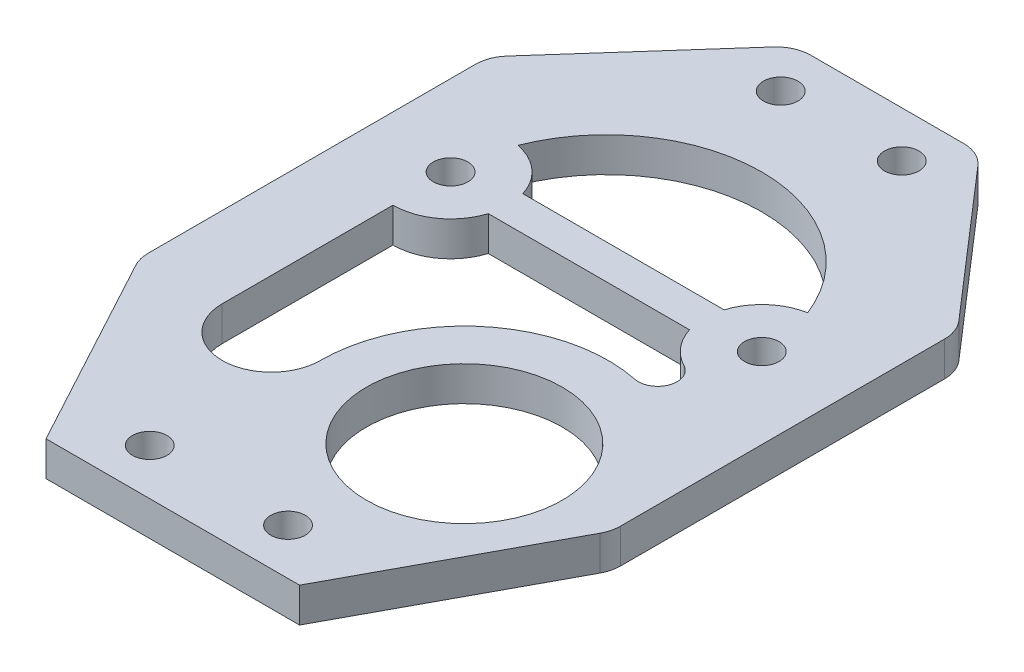
ISO-10303-21;
HEADER;
FILE_DESCRIPTION(('STEP AP214'),'2;1');
FILE_NAME('part.step','',(''),(''),'','','');
FILE_SCHEMA(('AUTOMOTIVE_DESIGN { 1 0 10303 214 1 1 1 1 }'));
ENDSEC;
DATA;
#1=APPLICATION_CONTEXT('core data for automotive mechanical design processes');
#2=APPLICATION_PROTOCOL_DEFINITION('international standard','automotive_design',2000,#1);
#3=PRODUCT_CONTEXT('',#1,'mechanical');
#4=PRODUCT('Part','Part','',(#3));
#5=PRODUCT_RELATED_PRODUCT_CATEGORY('part','',(#4));
#6=PRODUCT_DEFINITION_FORMATION('','',#4);
#7=PRODUCT_DEFINITION_CONTEXT('part definition',#1,'design');
#8=PRODUCT_DEFINITION('design','',#6,#7);
#9=PRODUCT_DEFINITION_SHAPE('','',#8);
#10=(LENGTH_UNIT() NAMED_UNIT(*) SI_UNIT(.MILLI.,.METRE.));
#11=(NAMED_UNIT(*) PLANE_ANGLE_UNIT() SI_UNIT($,.RADIAN.));
#12=(NAMED_UNIT(*) SI_UNIT($,.STERADIAN.) SOLID_ANGLE_UNIT());
#13=UNCERTAINTY_MEASURE_WITH_UNIT(LENGTH_MEASURE(1.E-05),#10,'distance_accuracy_value','');
#14=(GEOMETRIC_REPRESENTATION_CONTEXT(3) GLOBAL_UNCERTAINTY_ASSIGNED_CONTEXT((#13)) GLOBAL_UNIT_ASSIGNED_CONTEXT((#10,
#11,#12)) REPRESENTATION_CONTEXT('',''));
#15=CARTESIAN_POINT('',(0.,0.,0.));
#16=DIRECTION('',(0.,0.,1.));
#17=DIRECTION('',(1.,0.,0.));
#18=AXIS2_PLACEMENT_3D('',#15,#16,#17);
#19=CARTESIAN_POINT('',(0.,3.,0.));
#20=DIRECTION('',(0.,-1.,0.));
#21=DIRECTION('',(0.,0.,-1.));
#22=AXIS2_PLACEMENT_3D('',#19,#20,#21);
#23=PLANE('',#22);
#24=CARTESIAN_POINT('',(0.,3.,-37.6053139252812));
#25=DIRECTION('',(0.,1.,0.));
#26=DIRECTION('',(0.,0.,1.));
#27=AXIS2_PLACEMENT_3D('',#24,#25,#26);
#28=CIRCLE('',#27,13.5);
#29=CARTESIAN_POINT('',(12.5740740740741,3.,-42.5188321332151));
#30=VERTEX_POINT('',#29);
#31=CARTESIAN_POINT('',(-12.5740740740741,3.,-42.5188321332151));
#32=VERTEX_POINT('',#31);
#33=EDGE_CURVE('E265',#30,#32,#28,.T.);
#34=ORIENTED_EDGE('',*,*,#33,.F.);
#35=CARTESIAN_POINT('',(13.5,3.,-37.6053139252812));
#36=DIRECTION('',(0.,-1.,0.));
#37=DIRECTION('',(0.,0.,1.));
#38=AXIS2_PLACEMENT_3D('',#35,#36,#37);
#39=CIRCLE('',#38,5.);
#40=CARTESIAN_POINT('',(8.73030399291527,3.,-39.1053139252812));
#41=VERTEX_POINT('',#40);
#42=EDGE_CURVE('E273',#41,#30,#39,.T.);
#43=ORIENTED_EDGE('',*,*,#42,.F.);
#44=DIRECTION('',(1.,0.,0.));
#45=VECTOR('',#44,1.);
#46=CARTESIAN_POINT('',(-8.73030399291527,3.,-39.1053139252812));
#47=LINE('',#46,#45);
#48=CARTESIAN_POINT('',(-8.73030399291527,3.,-39.1053139252812));
#49=VERTEX_POINT('',#48);
#50=EDGE_CURVE('E270',#49,#41,#47,.T.);
#51=ORIENTED_EDGE('',*,*,#50,.F.);
#52=CARTESIAN_POINT('',(-13.5,3.,-37.6053139252812));
#53=DIRECTION('',(0.,-1.,0.));
#54=DIRECTION('',(0.,0.,1.));
#55=AXIS2_PLACEMENT_3D('',#52,#53,#54);
#56=CIRCLE('',#55,5.);
#57=EDGE_CURVE('E267',#32,#49,#56,.T.);
#58=ORIENTED_EDGE('',*,*,#57,.F.);
#59=EDGE_LOOP('',(#34,#43,#51,#58));
#60=FACE_BOUND('',#59,.T.);
#61=DIRECTION('',(-0.655356752303595,0.,-0.755319486846516));
#62=VECTOR('',#61,1.);
#63=CARTESIAN_POINT('',(20.4896217834169,3.,-47.6053139252812));
#64=LINE('',#63,#62);
#65=CARTESIAN_POINT('',(19.7555802439564,3.,-48.4513201302382));
#66=VERTEX_POINT('',#65);
#67=CARTESIAN_POINT('',(8.897094342647,3.,-60.9660702569108));
#68=VERTEX_POINT('',#67);
#69=EDGE_CURVE('E349',#66,#68,#64,.T.);
#70=ORIENTED_EDGE('',*,*,#69,.T.);
#71=CARTESIAN_POINT('',(6.63113588210745,3.,-59.));
#72=DIRECTION('',(0.,-1.,0.));
#73=DIRECTION('',(0.,0.,-1.));
#74=AXIS2_PLACEMENT_3D('',#71,#72,#73);
#75=CIRCLE('',#74,3.);
#76=CARTESIAN_POINT('',(6.63113588210745,3.,-62.));
#77=VERTEX_POINT('',#76);
#78=EDGE_CURVE('E415',#68,#77,#75,.F.);
#79=ORIENTED_EDGE('',*,*,#78,.T.);
#80=DIRECTION('',(-1.,0.,0.));
#81=VECTOR('',#80,1.);
#82=CARTESIAN_POINT('',(-8.,3.,-62.));
#83=LINE('',#82,#81);
#84=CARTESIAN_POINT('',(-6.65173417985051,3.,-62.));
#85=VERTEX_POINT('',#84);
#86=EDGE_CURVE('E352',#77,#85,#83,.T.);
#87=ORIENTED_EDGE('',*,*,#86,.T.);
#88=CARTESIAN_POINT('',(-6.65173417985051,3.,-59.));
#89=DIRECTION('',(0.,-1.,0.));
#90=DIRECTION('',(0.,0.,-1.));
#91=AXIS2_PLACEMENT_3D('',#88,#89,#90);
#92=CIRCLE('',#91,3.);
#93=CARTESIAN_POINT('',(-8.89514210708874,3.,-60.9917632570174));
#94=VERTEX_POINT('',#93);
#95=EDGE_CURVE('E407',#85,#94,#92,.F.);
#96=ORIENTED_EDGE('',*,*,#95,.T.);
#97=DIRECTION('',(-0.663921085672479,0.,0.747802642412741));
#98=VECTOR('',#97,1.);
#99=CARTESIAN_POINT('',(-20.5092438158278,3.,-47.9103050318304));
#100=LINE('',#99,#98);
#101=CARTESIAN_POINT('',(-19.752651743066,3.,-48.7624869604503));
#102=VERTEX_POINT('',#101);
#103=EDGE_CURVE('E355',#94,#102,#100,.T.);
#104=ORIENTED_EDGE('',*,*,#103,.T.);
#105=CARTESIAN_POINT('',(-17.5092438158278,3.,-46.7707237034328));
#106=DIRECTION('',(0.,-1.,0.));
#107=DIRECTION('',(0.,0.,-1.));
#108=AXIS2_PLACEMENT_3D('',#105,#106,#107);
#109=CIRCLE('',#108,3.);
#110=CARTESIAN_POINT('',(-20.5092438158278,3.,-46.7707237034328));
#111=VERTEX_POINT('',#110);
#112=EDGE_CURVE('E54',#102,#111,#109,.F.);
#113=ORIENTED_EDGE('',*,*,#112,.T.);
#114=DIRECTION('',(0.,0.,1.));
#115=VECTOR('',#114,1.);
#116=CARTESIAN_POINT('',(-20.5092438158278,3.,-17.6107061318947));
#117=LINE('',#116,#115);
#118=CARTESIAN_POINT('',(-20.5092438158278,3.,-18.3689229306085));
#119=VERTEX_POINT('',#118);
#120=EDGE_CURVE('E357',#111,#119,#117,.T.);
#121=ORIENTED_EDGE('',*,*,#120,.T.);
#122=CARTESIAN_POINT('',(-17.5092438158278,3.,-18.3689229306085));
#123=DIRECTION('',(0.,-1.,0.));
#124=DIRECTION('',(0.,0.,-1.));
#125=AXIS2_PLACEMENT_3D('',#122,#123,#124);
#126=CIRCLE('',#125,3.);
#127=CARTESIAN_POINT('',(-20.1489936922811,3.,-16.9435385649848));
#128=VERTEX_POINT('',#127);
#129=EDGE_CURVE('E409',#119,#128,#126,.F.);
#130=ORIENTED_EDGE('',*,*,#129,.T.);
#131=DIRECTION('',(0.475128121874568,0.,0.879916625484452));
#132=VECTOR('',#131,1.);
#133=CARTESIAN_POINT('',(-11.,3.,0.));
#134=LINE('',#133,#132);
#135=CARTESIAN_POINT('',(-11.,3.,0.));
#136=VERTEX_POINT('',#135);
#137=EDGE_CURVE('E338',#128,#136,#134,.T.);
#138=ORIENTED_EDGE('',*,*,#137,.T.);
#139=DIRECTION('',(1.,0.,0.));
#140=VECTOR('',#139,1.);
#141=CARTESIAN_POINT('',(-11.,3.,0.));
#142=LINE('',#141,#140);
#143=CARTESIAN_POINT('',(11.,3.,0.));
#144=VERTEX_POINT('',#143);
#145=EDGE_CURVE('E340',#136,#144,#142,.T.);
#146=ORIENTED_EDGE('',*,*,#145,.T.);
#147=DIRECTION('',(0.474481089170844,0.,-0.88026569626406));
#148=VECTOR('',#147,1.);
#149=CARTESIAN_POINT('',(11.,3.,0.));
#150=LINE('',#149,#148);
#151=CARTESIAN_POINT('',(20.1304188722091,3.,-16.9389143406592));
#152=VERTEX_POINT('',#151);
#153=EDGE_CURVE('E343',#144,#152,#150,.T.);
#154=ORIENTED_EDGE('',*,*,#153,.T.);
#155=CARTESIAN_POINT('',(17.4896217834169,3.,-18.3623576081718));
#156=DIRECTION('',(0.,-1.,0.));
#157=DIRECTION('',(0.,0.,-1.));
#158=AXIS2_PLACEMENT_3D('',#155,#156,#157);
#159=CIRCLE('',#158,3.);
#160=CARTESIAN_POINT('',(20.4896217834169,3.,-18.3623576081718));
#161=VERTEX_POINT('',#160);
#162=EDGE_CURVE('E411',#152,#161,#159,.F.);
#163=ORIENTED_EDGE('',*,*,#162,.T.);
#164=DIRECTION('',(0.,0.,-1.));
#165=VECTOR('',#164,1.);
#166=CARTESIAN_POINT('',(20.4896217834169,3.,-17.6053139252812));
#167=LINE('',#166,#165);
#168=CARTESIAN_POINT('',(20.4896217834169,3.,-46.4852498733274));
#169=VERTEX_POINT('',#168);
#170=EDGE_CURVE('E346',#161,#169,#167,.T.);
#171=ORIENTED_EDGE('',*,*,#170,.T.);
#172=CARTESIAN_POINT('',(17.4896217834169,3.,-46.4852498733274));
#173=DIRECTION('',(0.,-1.,0.));
#174=DIRECTION('',(0.,0.,-1.));
#175=AXIS2_PLACEMENT_3D('',#172,#173,#174);
#176=CIRCLE('',#175,3.);
#177=EDGE_CURVE('E413',#169,#66,#176,.F.);
#178=ORIENTED_EDGE('',*,*,#177,.T.);
#179=EDGE_LOOP('',(#70,#79,#87,#96,#104,#113,#121,#130,#138,#146,#154,#163,#171,#178));
#180=FACE_BOUND('',#179,.T.);
#181=CARTESIAN_POINT('',(7.51967974135512,3.,-17.7802522731615));
#182=DIRECTION('',(0.,1.,0.));
#183=DIRECTION('',(0.,0.,1.));
#184=AXIS2_PLACEMENT_3D('',#181,#182,#183);
#185=CIRCLE('',#184,8.5);
#186=CARTESIAN_POINT('',(7.51967974135512,3.,-9.28025227316154));
#187=VERTEX_POINT('',#186);
#188=EDGE_CURVE('E332',#187,#187,#185,.T.);
#189=ORIENTED_EDGE('',*,*,#188,.F.);
#190=EDGE_LOOP('',(#189));
#191=FACE_BOUND('',#190,.T.);
#192=CARTESIAN_POINT('',(6.,3.,-4.));
#193=DIRECTION('',(0.,1.,0.));
#194=DIRECTION('',(0.,0.,1.));
#195=AXIS2_PLACEMENT_3D('',#192,#193,#194);
#196=CIRCLE('',#195,1.5);
#197=CARTESIAN_POINT('',(6.,3.,-2.5));
#198=VERTEX_POINT('',#197);
#199=EDGE_CURVE('E326',#198,#198,#196,.T.);
#200=ORIENTED_EDGE('',*,*,#199,.F.);
#201=EDGE_LOOP('',(#200));
#202=FACE_BOUND('',#201,.T.);
#203=CARTESIAN_POINT('',(-6.,3.,-4.));
#204=DIRECTION('',(0.,1.,0.));
#205=DIRECTION('',(0.,0.,-1.));
#206=AXIS2_PLACEMENT_3D('',#203,#204,#205);
#207=CIRCLE('',#206,1.5);
#208=CARTESIAN_POINT('',(-6.,3.,-5.5));
#209=VERTEX_POINT('',#208);
#210=EDGE_CURVE('E320',#209,#209,#207,.T.);
#211=ORIENTED_EDGE('',*,*,#210,.F.);
#212=EDGE_LOOP('',(#211));
#213=FACE_BOUND('',#212,.T.);
#214=CARTESIAN_POINT('',(-5.25,3.,-57.9998597647943));
#215=DIRECTION('',(0.,1.,0.));
#216=DIRECTION('',(0.,0.,1.));
#217=AXIS2_PLACEMENT_3D('',#214,#215,#216);
#218=CIRCLE('',#217,1.5);
#219=CARTESIAN_POINT('',(-5.25,3.,-56.4998597647943));
#220=VERTEX_POINT('',#219);
#221=EDGE_CURVE('E314',#220,#220,#218,.T.);
#222=ORIENTED_EDGE('',*,*,#221,.F.);
#223=EDGE_LOOP('',(#222));
#224=FACE_BOUND('',#223,.T.);
#225=CARTESIAN_POINT('',(5.25,3.,-57.9998597647943));
#226=DIRECTION('',(0.,1.,0.));
#227=DIRECTION('',(0.,0.,1.));
#228=AXIS2_PLACEMENT_3D('',#225,#226,#227);
#229=CIRCLE('',#228,1.5);
#230=CARTESIAN_POINT('',(5.25,3.,-56.4998597647943));
#231=VERTEX_POINT('',#230);
#232=EDGE_CURVE('E308',#231,#231,#229,.T.);
#233=ORIENTED_EDGE('',*,*,#232,.F.);
#234=EDGE_LOOP('',(#233));
#235=FACE_BOUND('',#234,.T.);
#236=CARTESIAN_POINT('',(-13.5,3.,-37.6053139252812));
#237=DIRECTION('',(0.,1.,0.));
#238=DIRECTION('',(0.,0.,1.));
#239=AXIS2_PLACEMENT_3D('',#236,#237,#238);
#240=CIRCLE('',#239,1.5);
#241=CARTESIAN_POINT('',(-13.5,3.,-36.1053139252812));
#242=VERTEX_POINT('',#241);
#243=EDGE_CURVE('E302',#242,#242,#240,.T.);
#244=ORIENTED_EDGE('',*,*,#243,.F.);
#245=EDGE_LOOP('',(#244));
#246=FACE_BOUND('',#245,.T.);
#247=CARTESIAN_POINT('',(13.5,3.,-37.6053139252812));
#248=DIRECTION('',(0.,1.,0.));
#249=DIRECTION('',(0.,0.,1.));
#250=AXIS2_PLACEMENT_3D('',#247,#248,#249);
#251=CIRCLE('',#250,1.5);
#252=CARTESIAN_POINT('',(13.5,3.,-36.1053139252812));
#253=VERTEX_POINT('',#252);
#254=EDGE_CURVE('E296',#253,#253,#251,.T.);
#255=ORIENTED_EDGE('',*,*,#254,.F.);
#256=EDGE_LOOP('',(#255));
#257=FACE_BOUND('',#256,.T.);
#258=CARTESIAN_POINT('',(10.4065115949403,3.,-31.6734989005387));
#259=DIRECTION('',(0.,1.,0.));
#260=DIRECTION('',(0.,0.,1.));
#261=AXIS2_PLACEMENT_3D('',#258,#259,#260);
#262=CIRCLE('',#261,1.69);
#263=CARTESIAN_POINT('',(10.0626958209756,3.,-30.0188416207453));
#264=VERTEX_POINT('',#263);
#265=CARTESIAN_POINT('',(11.1879757809718,3.,-33.1719693626934));
#266=VERTEX_POINT('',#265);
#267=EDGE_CURVE('E202',#264,#266,#262,.T.);
#268=ORIENTED_EDGE('',*,*,#267,.F.);
#269=CARTESIAN_POINT('',(7.51967974135512,3.,-17.7802522731615));
#270=DIRECTION('',(0.,-1.,0.));
#271=DIRECTION('',(0.,0.,1.));
#272=AXIS2_PLACEMENT_3D('',#269,#270,#271);
#273=CIRCLE('',#272,12.5);
#274=CARTESIAN_POINT('',(-4.98031895754973,3.,-17.7859555508932));
#275=VERTEX_POINT('',#274);
#276=EDGE_CURVE('E236',#275,#264,#273,.T.);
#277=ORIENTED_EDGE('',*,*,#276,.F.);
#278=CARTESIAN_POINT('',(-9.24015925707654,3.,-17.7878991552812));
#279=DIRECTION('',(0.,1.,0.));
#280=DIRECTION('',(0.,0.,1.));
#281=AXIS2_PLACEMENT_3D('',#278,#279,#280);
#282=CIRCLE('',#281,4.25984074292346);
#283=CARTESIAN_POINT('',(-13.5,3.,-17.7878991552812));
#284=VERTEX_POINT('',#283);
#285=EDGE_CURVE('E233',#284,#275,#282,.T.);
#286=ORIENTED_EDGE('',*,*,#285,.F.);
#287=DIRECTION('',(0.,0.,1.));
#288=VECTOR('',#287,1.);
#289=CARTESIAN_POINT('',(-13.5,3.,-32.6053139252812));
#290=LINE('',#289,#288);
#291=CARTESIAN_POINT('',(-13.5,3.,-32.6053139252812));
#292=VERTEX_POINT('',#291);
#293=EDGE_CURVE('E231',#292,#284,#290,.T.);
#294=ORIENTED_EDGE('',*,*,#293,.F.);
#295=CARTESIAN_POINT('',(-13.5,3.,-37.6053139252812));
#296=DIRECTION('',(0.,-1.,0.));
#297=DIRECTION('',(0.,0.,1.));
#298=AXIS2_PLACEMENT_3D('',#295,#296,#297);
#299=CIRCLE('',#298,5.);
#300=CARTESIAN_POINT('',(-8.73030399291527,3.,-36.1053139252812));
#301=VERTEX_POINT('',#300);
#302=EDGE_CURVE('E227',#301,#292,#299,.T.);
#303=ORIENTED_EDGE('',*,*,#302,.F.);
#304=DIRECTION('',(-1.,0.,0.));
#305=VECTOR('',#304,1.);
#306=CARTESIAN_POINT('',(-8.73030399291527,3.,-36.1053139252812));
#307=LINE('',#306,#305);
#308=CARTESIAN_POINT('',(8.73030399291527,3.,-36.1053139252812));
#309=VERTEX_POINT('',#308);
#310=EDGE_CURVE('E225',#309,#301,#307,.T.);
#311=ORIENTED_EDGE('',*,*,#310,.F.);
#312=CARTESIAN_POINT('',(13.5,3.,-37.6053139252812));
#313=DIRECTION('',(0.,-1.,0.));
#314=DIRECTION('',(0.,0.,1.));
#315=AXIS2_PLACEMENT_3D('',#312,#313,#314);
#316=CIRCLE('',#315,5.);
#317=EDGE_CURVE('E212',#266,#309,#316,.T.);
#318=ORIENTED_EDGE('',*,*,#317,.F.);
#319=EDGE_LOOP('',(#268,#277,#286,#294,#303,#311,#318));
#320=FACE_BOUND('',#319,.T.);
#321=ADVANCED_FACE('F32',(#60,#180,#191,#202,#213,#224,#235,#246,#257,#320),#23,.F.);
#322=CARTESIAN_POINT('',(0.,0.,0.));
#323=DIRECTION('',(0.,-1.,0.));
#324=DIRECTION('',(0.,0.,-1.));
#325=AXIS2_PLACEMENT_3D('',#322,#323,#324);
#326=PLANE('',#325);
#327=CARTESIAN_POINT('',(-13.5,0.,-37.6053139252812));
#328=DIRECTION('',(0.,1.,0.));
#329=DIRECTION('',(0.,0.,1.));
#330=AXIS2_PLACEMENT_3D('',#327,#328,#329);
#331=CIRCLE('',#330,1.5);
#332=CARTESIAN_POINT('',(-13.5,0.,-36.1053139252812));
#333=VERTEX_POINT('',#332);
#334=EDGE_CURVE('E299',#333,#333,#331,.T.);
#335=ORIENTED_EDGE('',*,*,#334,.T.);
#336=EDGE_LOOP('',(#335));
#337=FACE_BOUND('',#336,.T.);
#338=CARTESIAN_POINT('',(-5.25,0.,-57.9998597647943));
#339=DIRECTION('',(0.,1.,0.));
#340=DIRECTION('',(0.,0.,1.));
#341=AXIS2_PLACEMENT_3D('',#338,#339,#340);
#342=CIRCLE('',#341,1.5);
#343=CARTESIAN_POINT('',(-5.25,0.,-56.4998597647943));
#344=VERTEX_POINT('',#343);
#345=EDGE_CURVE('E311',#344,#344,#342,.T.);
#346=ORIENTED_EDGE('',*,*,#345,.T.);
#347=EDGE_LOOP('',(#346));
#348=FACE_BOUND('',#347,.T.);
#349=CARTESIAN_POINT('',(6.,0.,-4.));
#350=DIRECTION('',(0.,1.,0.));
#351=DIRECTION('',(0.,0.,1.));
#352=AXIS2_PLACEMENT_3D('',#349,#350,#351);
#353=CIRCLE('',#352,1.5);
#354=CARTESIAN_POINT('',(6.,0.,-2.5));
#355=VERTEX_POINT('',#354);
#356=EDGE_CURVE('E323',#355,#355,#353,.T.);
#357=ORIENTED_EDGE('',*,*,#356,.T.);
#358=EDGE_LOOP('',(#357));
#359=FACE_BOUND('',#358,.T.);
#360=DIRECTION('',(-1.,0.,0.));
#361=VECTOR('',#360,1.);
#362=CARTESIAN_POINT('',(-8.,0.,-62.));
#363=LINE('',#362,#361);
#364=CARTESIAN_POINT('',(6.63113588210745,0.,-62.));
#365=VERTEX_POINT('',#364);
#366=CARTESIAN_POINT('',(-6.65173417985051,0.,-62.));
#367=VERTEX_POINT('',#366);
#368=EDGE_CURVE('E372',#365,#367,#363,.T.);
#369=ORIENTED_EDGE('',*,*,#368,.F.);
#370=CARTESIAN_POINT('',(6.63113588210745,0.,-59.));
#371=DIRECTION('',(0.,-1.,0.));
#372=DIRECTION('',(0.,0.,-1.));
#373=AXIS2_PLACEMENT_3D('',#370,#371,#372);
#374=CIRCLE('',#373,3.);
#375=CARTESIAN_POINT('',(8.897094342647,0.,-60.9660702569108));
#376=VERTEX_POINT('',#375);
#377=EDGE_CURVE('E399',#365,#376,#374,.T.);
#378=ORIENTED_EDGE('',*,*,#377,.T.);
#379=DIRECTION('',(-0.655356752303595,0.,-0.755319486846516));
#380=VECTOR('',#379,1.);
#381=CARTESIAN_POINT('',(20.4896217834169,0.,-47.6053139252812));
#382=LINE('',#381,#380);
#383=CARTESIAN_POINT('',(19.7555802439564,0.,-48.4513201302382));
#384=VERTEX_POINT('',#383);
#385=EDGE_CURVE('E369',#384,#376,#382,.T.);
#386=ORIENTED_EDGE('',*,*,#385,.F.);
#387=CARTESIAN_POINT('',(17.4896217834169,0.,-46.4852498733274));
#388=DIRECTION('',(0.,-1.,0.));
#389=DIRECTION('',(0.,0.,-1.));
#390=AXIS2_PLACEMENT_3D('',#387,#388,#389);
#391=CIRCLE('',#390,3.);
#392=CARTESIAN_POINT('',(20.4896217834169,0.,-46.4852498733274));
#393=VERTEX_POINT('',#392);
#394=EDGE_CURVE('E397',#384,#393,#391,.T.);
#395=ORIENTED_EDGE('',*,*,#394,.T.);
#396=DIRECTION('',(0.,0.,-1.));
#397=VECTOR('',#396,1.);
#398=CARTESIAN_POINT('',(20.4896217834169,0.,-17.6053139252812));
#399=LINE('',#398,#397);
#400=CARTESIAN_POINT('',(20.4896217834169,0.,-18.3623576081718));
#401=VERTEX_POINT('',#400);
#402=EDGE_CURVE('E366',#401,#393,#399,.T.);
#403=ORIENTED_EDGE('',*,*,#402,.F.);
#404=CARTESIAN_POINT('',(17.4896217834169,0.,-18.3623576081718));
#405=DIRECTION('',(0.,-1.,0.));
#406=DIRECTION('',(0.,0.,-1.));
#407=AXIS2_PLACEMENT_3D('',#404,#405,#406);
#408=CIRCLE('',#407,3.);
#409=CARTESIAN_POINT('',(20.1304188722091,0.,-16.9389143406592));
#410=VERTEX_POINT('',#409);
#411=EDGE_CURVE('E395',#401,#410,#408,.T.);
#412=ORIENTED_EDGE('',*,*,#411,.T.);
#413=DIRECTION('',(0.474481089170844,0.,-0.88026569626406));
#414=VECTOR('',#413,1.);
#415=CARTESIAN_POINT('',(11.,0.,0.));
#416=LINE('',#415,#414);
#417=CARTESIAN_POINT('',(11.,0.,0.));
#418=VERTEX_POINT('',#417);
#419=EDGE_CURVE('E363',#418,#410,#416,.T.);
#420=ORIENTED_EDGE('',*,*,#419,.F.);
#421=DIRECTION('',(1.,0.,0.));
#422=VECTOR('',#421,1.);
#423=CARTESIAN_POINT('',(-11.,0.,0.));
#424=LINE('',#423,#422);
#425=CARTESIAN_POINT('',(-11.,0.,0.));
#426=VERTEX_POINT('',#425);
#427=EDGE_CURVE('E361',#426,#418,#424,.T.);
#428=ORIENTED_EDGE('',*,*,#427,.F.);
#429=DIRECTION('',(0.475128121874568,0.,0.879916625484452));
#430=VECTOR('',#429,1.);
#431=CARTESIAN_POINT('',(-11.,0.,0.));
#432=LINE('',#431,#430);
#433=CARTESIAN_POINT('',(-20.1489936922811,0.,-16.9435385649848));
#434=VERTEX_POINT('',#433);
#435=EDGE_CURVE('E335',#434,#426,#432,.T.);
#436=ORIENTED_EDGE('',*,*,#435,.F.);
#437=CARTESIAN_POINT('',(-17.5092438158278,0.,-18.3689229306085));
#438=DIRECTION('',(0.,-1.,0.));
#439=DIRECTION('',(0.,0.,-1.));
#440=AXIS2_PLACEMENT_3D('',#437,#438,#439);
#441=CIRCLE('',#440,3.);
#442=CARTESIAN_POINT('',(-20.5092438158278,0.,-18.3689229306085));
#443=VERTEX_POINT('',#442);
#444=EDGE_CURVE('E393',#434,#443,#441,.T.);
#445=ORIENTED_EDGE('',*,*,#444,.T.);
#446=DIRECTION('',(0.,0.,1.));
#447=VECTOR('',#446,1.);
#448=CARTESIAN_POINT('',(-20.5092438158278,0.,-17.6107061318947));
#449=LINE('',#448,#447);
#450=CARTESIAN_POINT('',(-20.5092438158278,0.,-46.7707237034328));
#451=VERTEX_POINT('',#450);
#452=EDGE_CURVE('E341',#451,#443,#449,.T.);
#453=ORIENTED_EDGE('',*,*,#452,.F.);
#454=CARTESIAN_POINT('',(-17.5092438158278,0.,-46.7707237034328));
#455=DIRECTION('',(0.,-1.,0.));
#456=DIRECTION('',(0.,0.,-1.));
#457=AXIS2_PLACEMENT_3D('',#454,#455,#456);
#458=CIRCLE('',#457,3.);
#459=CARTESIAN_POINT('',(-19.752651743066,0.,-48.7624869604503));
#460=VERTEX_POINT('',#459);
#461=EDGE_CURVE('E389',#451,#460,#458,.T.);
#462=ORIENTED_EDGE('',*,*,#461,.T.);
#463=DIRECTION('',(-0.663921085672479,0.,0.747802642412741));
#464=VECTOR('',#463,1.);
#465=CARTESIAN_POINT('',(-20.5092438158278,0.,-47.9103050318304));
#466=LINE('',#465,#464);
#467=CARTESIAN_POINT('',(-8.89514210708874,0.,-60.9917632570174));
#468=VERTEX_POINT('',#467);
#469=EDGE_CURVE('E375',#468,#460,#466,.T.);
#470=ORIENTED_EDGE('',*,*,#469,.F.);
#471=CARTESIAN_POINT('',(-6.65173417985051,0.,-59.));
#472=DIRECTION('',(0.,-1.,0.));
#473=DIRECTION('',(0.,0.,-1.));
#474=AXIS2_PLACEMENT_3D('',#471,#472,#473);
#475=CIRCLE('',#474,3.);
#476=EDGE_CURVE('E391',#468,#367,#475,.T.);
#477=ORIENTED_EDGE('',*,*,#476,.T.);
#478=EDGE_LOOP('',(#369,#378,#386,#395,#403,#412,#420,#428,#436,#445,#453,#462,#470,#477));
#479=FACE_BOUND('',#478,.T.);
#480=CARTESIAN_POINT('',(7.51967974135512,0.,-17.7802522731615));
#481=DIRECTION('',(0.,1.,0.));
#482=DIRECTION('',(0.,0.,1.));
#483=AXIS2_PLACEMENT_3D('',#480,#481,#482);
#484=CIRCLE('',#483,8.5);
#485=CARTESIAN_POINT('',(7.51967974135512,0.,-9.28025227316154));
#486=VERTEX_POINT('',#485);
#487=EDGE_CURVE('E329',#486,#486,#484,.T.);
#488=ORIENTED_EDGE('',*,*,#487,.T.);
#489=EDGE_LOOP('',(#488));
#490=FACE_BOUND('',#489,.T.);
#491=CARTESIAN_POINT('',(-6.,0.,-4.));
#492=DIRECTION('',(0.,1.,0.));
#493=DIRECTION('',(0.,0.,-1.));
#494=AXIS2_PLACEMENT_3D('',#491,#492,#493);
#495=CIRCLE('',#494,1.5);
#496=CARTESIAN_POINT('',(-6.,0.,-5.5));
#497=VERTEX_POINT('',#496);
#498=EDGE_CURVE('E317',#497,#497,#495,.T.);
#499=ORIENTED_EDGE('',*,*,#498,.T.);
#500=EDGE_LOOP('',(#499));
#501=FACE_BOUND('',#500,.T.);
#502=CARTESIAN_POINT('',(5.25,0.,-57.9998597647943));
#503=DIRECTION('',(0.,1.,0.));
#504=DIRECTION('',(0.,0.,1.));
#505=AXIS2_PLACEMENT_3D('',#502,#503,#504);
#506=CIRCLE('',#505,1.5);
#507=CARTESIAN_POINT('',(5.25,0.,-56.4998597647943));
#508=VERTEX_POINT('',#507);
#509=EDGE_CURVE('E305',#508,#508,#506,.T.);
#510=ORIENTED_EDGE('',*,*,#509,.T.);
#511=EDGE_LOOP('',(#510));
#512=FACE_BOUND('',#511,.T.);
#513=CARTESIAN_POINT('',(13.5,0.,-37.6053139252812));
#514=DIRECTION('',(0.,1.,0.));
#515=DIRECTION('',(0.,0.,1.));
#516=AXIS2_PLACEMENT_3D('',#513,#514,#515);
#517=CIRCLE('',#516,1.5);
#518=CARTESIAN_POINT('',(13.5,0.,-36.1053139252812));
#519=VERTEX_POINT('',#518);
#520=EDGE_CURVE('E295',#519,#519,#517,.T.);
#521=ORIENTED_EDGE('',*,*,#520,.T.);
#522=EDGE_LOOP('',(#521));
#523=FACE_BOUND('',#522,.T.);
#524=CARTESIAN_POINT('',(13.5,0.,-37.6053139252812));
#525=DIRECTION('',(0.,-1.,0.));
#526=DIRECTION('',(0.,0.,1.));
#527=AXIS2_PLACEMENT_3D('',#524,#525,#526);
#528=CIRCLE('',#527,5.);
#529=CARTESIAN_POINT('',(8.73030399291527,0.,-39.1053139252812));
#530=VERTEX_POINT('',#529);
#531=CARTESIAN_POINT('',(12.5740740740741,0.,-42.5188321332151));
#532=VERTEX_POINT('',#531);
#533=EDGE_CURVE('E268',#530,#532,#528,.T.);
#534=ORIENTED_EDGE('',*,*,#533,.T.);
#535=CARTESIAN_POINT('',(0.,0.,-37.6053139252812));
#536=DIRECTION('',(0.,1.,0.));
#537=DIRECTION('',(0.,0.,1.));
#538=AXIS2_PLACEMENT_3D('',#535,#536,#537);
#539=CIRCLE('',#538,13.5);
#540=CARTESIAN_POINT('',(-12.5740740740741,0.,-42.5188321332151));
#541=VERTEX_POINT('',#540);
#542=EDGE_CURVE('E220',#532,#541,#539,.T.);
#543=ORIENTED_EDGE('',*,*,#542,.T.);
#544=CARTESIAN_POINT('',(-13.5,0.,-37.6053139252812));
#545=DIRECTION('',(0.,-1.,0.));
#546=DIRECTION('',(0.,0.,1.));
#547=AXIS2_PLACEMENT_3D('',#544,#545,#546);
#548=CIRCLE('',#547,5.);
#549=CARTESIAN_POINT('',(-8.73030399291527,0.,-39.1053139252812));
#550=VERTEX_POINT('',#549);
#551=EDGE_CURVE('E278',#541,#550,#548,.T.);
#552=ORIENTED_EDGE('',*,*,#551,.T.);
#553=DIRECTION('',(1.,0.,0.));
#554=VECTOR('',#553,1.);
#555=CARTESIAN_POINT('',(-8.73030399291527,0.,-39.1053139252812));
#556=LINE('',#555,#554);
#557=EDGE_CURVE('E281',#550,#530,#556,.T.);
#558=ORIENTED_EDGE('',*,*,#557,.T.);
#559=EDGE_LOOP('',(#534,#543,#552,#558));
#560=FACE_BOUND('',#559,.T.);
#561=CARTESIAN_POINT('',(7.51967974135512,0.,-17.7802522731615));
#562=DIRECTION('',(0.,-1.,0.));
#563=DIRECTION('',(0.,0.,1.));
#564=AXIS2_PLACEMENT_3D('',#561,#562,#563);
#565=CIRCLE('',#564,12.5);
#566=CARTESIAN_POINT('',(-4.98031895754973,0.,-17.7859555508932));
#567=VERTEX_POINT('',#566);
#568=CARTESIAN_POINT('',(10.0626958209756,0.,-30.0188416207453));
#569=VERTEX_POINT('',#568);
#570=EDGE_CURVE('E213',#567,#569,#565,.T.);
#571=ORIENTED_EDGE('',*,*,#570,.T.);
#572=CARTESIAN_POINT('',(10.4065115949403,0.,-31.6734989005387));
#573=DIRECTION('',(0.,1.,0.));
#574=DIRECTION('',(0.,0.,1.));
#575=AXIS2_PLACEMENT_3D('',#572,#573,#574);
#576=CIRCLE('',#575,1.69);
#577=CARTESIAN_POINT('',(11.1879757809718,0.,-33.1719693626934));
#578=VERTEX_POINT('',#577);
#579=EDGE_CURVE('E238',#569,#578,#576,.T.);
#580=ORIENTED_EDGE('',*,*,#579,.T.);
#581=CARTESIAN_POINT('',(13.5,0.,-37.6053139252812));
#582=DIRECTION('',(0.,-1.,0.));
#583=DIRECTION('',(0.,0.,1.));
#584=AXIS2_PLACEMENT_3D('',#581,#582,#583);
#585=CIRCLE('',#584,5.);
#586=CARTESIAN_POINT('',(8.73030399291527,0.,-36.1053139252812));
#587=VERTEX_POINT('',#586);
#588=EDGE_CURVE('E219',#578,#587,#585,.T.);
#589=ORIENTED_EDGE('',*,*,#588,.T.);
#590=DIRECTION('',(-1.,0.,0.));
#591=VECTOR('',#590,1.);
#592=CARTESIAN_POINT('',(-8.73030399291527,0.,-36.1053139252812));
#593=LINE('',#592,#591);
#594=CARTESIAN_POINT('',(-8.73030399291527,0.,-36.1053139252812));
#595=VERTEX_POINT('',#594);
#596=EDGE_CURVE('E241',#587,#595,#593,.T.);
#597=ORIENTED_EDGE('',*,*,#596,.T.);
#598=CARTESIAN_POINT('',(-13.5,0.,-37.6053139252812));
#599=DIRECTION('',(0.,-1.,0.));
#600=DIRECTION('',(0.,0.,1.));
#601=AXIS2_PLACEMENT_3D('',#598,#599,#600);
#602=CIRCLE('',#601,5.);
#603=CARTESIAN_POINT('',(-13.5,0.,-32.6053139252812));
#604=VERTEX_POINT('',#603);
#605=EDGE_CURVE('E244',#595,#604,#602,.T.);
#606=ORIENTED_EDGE('',*,*,#605,.T.);
#607=DIRECTION('',(0.,0.,1.));
#608=VECTOR('',#607,1.);
#609=CARTESIAN_POINT('',(-13.5,0.,-32.6053139252812));
#610=LINE('',#609,#608);
#611=CARTESIAN_POINT('',(-13.5,0.,-17.7878991552812));
#612=VERTEX_POINT('',#611);
#613=EDGE_CURVE('E247',#604,#612,#610,.T.);
#614=ORIENTED_EDGE('',*,*,#613,.T.);
#615=CARTESIAN_POINT('',(-9.24015925707654,0.,-17.7878991552812));
#616=DIRECTION('',(0.,1.,0.));
#617=DIRECTION('',(0.,0.,1.));
#618=AXIS2_PLACEMENT_3D('',#615,#616,#617);
#619=CIRCLE('',#618,4.25984074292346);
#620=EDGE_CURVE('E250',#612,#567,#619,.T.);
#621=ORIENTED_EDGE('',*,*,#620,.T.);
#622=EDGE_LOOP('',(#571,#580,#589,#597,#606,#614,#621));
#623=FACE_BOUND('',#622,.T.);
#624=ADVANCED_FACE('F444',(#337,#348,#359,#479,#490,#501,#512,#523,#560,#623),#326,.T.);
#625=CARTESIAN_POINT('',(-11.,3.,0.));
#626=DIRECTION('',(0.879916625484452,0.,-0.475128121874568));
#627=DIRECTION('',(-0.475128121874568,0.,-0.879916625484452));
#628=AXIS2_PLACEMENT_3D('',#625,#626,#627);
#629=PLANE('',#628);
#630=ORIENTED_EDGE('',*,*,#137,.F.);
#631=DIRECTION('',(0.,-1.,0.));
#632=VECTOR('',#631,1.);
#633=CARTESIAN_POINT('',(-20.1489936922811,3.,-16.9435385649848));
#634=LINE('',#633,#632);
#635=EDGE_CURVE('E424',#128,#434,#634,.T.);
#636=ORIENTED_EDGE('',*,*,#635,.T.);
#637=ORIENTED_EDGE('',*,*,#435,.T.);
#638=DIRECTION('',(0.,-1.,0.));
#639=VECTOR('',#638,1.);
#640=CARTESIAN_POINT('',(-11.,3.,0.));
#641=LINE('',#640,#639);
#642=EDGE_CURVE('E381',#136,#426,#641,.T.);
#643=ORIENTED_EDGE('',*,*,#642,.F.);
#644=EDGE_LOOP('',(#630,#636,#637,#643));
#645=FACE_BOUND('',#644,.T.);
#646=ADVANCED_FACE('F454',(#645),#629,.F.);
#647=CARTESIAN_POINT('',(-11.,3.,0.));
#648=DIRECTION('',(0.,0.,-1.));
#649=DIRECTION('',(-1.,0.,0.));
#650=AXIS2_PLACEMENT_3D('',#647,#648,#649);
#651=PLANE('',#650);
#652=ORIENTED_EDGE('',*,*,#427,.T.);
#653=DIRECTION('',(0.,-1.,0.));
#654=VECTOR('',#653,1.);
#655=CARTESIAN_POINT('',(11.,3.,0.));
#656=LINE('',#655,#654);
#657=EDGE_CURVE('E359',#144,#418,#656,.T.);
#658=ORIENTED_EDGE('',*,*,#657,.F.);
#659=ORIENTED_EDGE('',*,*,#145,.F.);
#660=ORIENTED_EDGE('',*,*,#642,.T.);
#661=EDGE_LOOP('',(#652,#658,#659,#660));
#662=FACE_BOUND('',#661,.T.);
#663=ADVANCED_FACE('F459',(#662),#651,.F.);
#664=CARTESIAN_POINT('',(11.,3.,0.));
#665=DIRECTION('',(-0.88026569626406,0.,-0.474481089170844));
#666=DIRECTION('',(-0.474481089170844,0.,0.88026569626406));
#667=AXIS2_PLACEMENT_3D('',#664,#665,#666);
#668=PLANE('',#667);
#669=ORIENTED_EDGE('',*,*,#419,.T.);
#670=DIRECTION('',(0.,-1.,0.));
#671=VECTOR('',#670,1.);
#672=CARTESIAN_POINT('',(20.1304188722091,3.,-16.9389143406592));
#673=LINE('',#672,#671);
#674=EDGE_CURVE('E422',#410,#152,#673,.F.);
#675=ORIENTED_EDGE('',*,*,#674,.T.);
#676=ORIENTED_EDGE('',*,*,#153,.F.);
#677=ORIENTED_EDGE('',*,*,#657,.T.);
#678=EDGE_LOOP('',(#669,#675,#676,#677));
#679=FACE_BOUND('',#678,.T.);
#680=ADVANCED_FACE('F463',(#679),#668,.F.);
#681=CARTESIAN_POINT('',(20.4896217834169,3.,-17.6053139252812));
#682=DIRECTION('',(-1.,0.,0.));
#683=DIRECTION('',(0.,0.,1.));
#684=AXIS2_PLACEMENT_3D('',#681,#682,#683);
#685=PLANE('',#684);
#686=ORIENTED_EDGE('',*,*,#402,.T.);
#687=DIRECTION('',(0.,-1.,0.));
#688=VECTOR('',#687,1.);
#689=CARTESIAN_POINT('',(20.4896217834169,3.,-46.4852498733274));
#690=LINE('',#689,#688);
#691=EDGE_CURVE('E420',#393,#169,#690,.F.);
#692=ORIENTED_EDGE('',*,*,#691,.T.);
#693=ORIENTED_EDGE('',*,*,#170,.F.);
#694=DIRECTION('',(0.,-1.,0.));
#695=VECTOR('',#694,1.);
#696=CARTESIAN_POINT('',(20.4896217834169,3.,-18.3623576081718));
#697=LINE('',#696,#695);
#698=EDGE_CURVE('E417',#161,#401,#697,.T.);
#699=ORIENTED_EDGE('',*,*,#698,.T.);
#700=EDGE_LOOP('',(#686,#692,#693,#699));
#701=FACE_BOUND('',#700,.T.);
#702=ADVANCED_FACE('F472',(#701),#685,.F.);
#703=CARTESIAN_POINT('',(20.4896217834169,3.,-47.6053139252812));
#704=DIRECTION('',(-0.755319486846516,0.,0.655356752303595));
#705=DIRECTION('',(0.655356752303595,0.,0.755319486846516));
#706=AXIS2_PLACEMENT_3D('',#703,#704,#705);
#707=PLANE('',#706);
#708=ORIENTED_EDGE('',*,*,#385,.T.);
#709=DIRECTION('',(0.,-1.,0.));
#710=VECTOR('',#709,1.);
#711=CARTESIAN_POINT('',(8.897094342647,3.,-60.9660702569108));
#712=LINE('',#711,#710);
#713=EDGE_CURVE('E404',#376,#68,#712,.F.);
#714=ORIENTED_EDGE('',*,*,#713,.T.);
#715=ORIENTED_EDGE('',*,*,#69,.F.);
#716=DIRECTION('',(0.,-1.,0.));
#717=VECTOR('',#716,1.);
#718=CARTESIAN_POINT('',(19.7555802439564,3.,-48.4513201302382));
#719=LINE('',#718,#717);
#720=EDGE_CURVE('E401',#66,#384,#719,.T.);
#721=ORIENTED_EDGE('',*,*,#720,.T.);
#722=EDGE_LOOP('',(#708,#714,#715,#721));
#723=FACE_BOUND('',#722,.T.);
#724=ADVANCED_FACE('F481',(#723),#707,.F.);
#725=CARTESIAN_POINT('',(-8.,3.,-62.));
#726=DIRECTION('',(0.,0.,1.));
#727=DIRECTION('',(1.,0.,0.));
#728=AXIS2_PLACEMENT_3D('',#725,#726,#727);
#729=PLANE('',#728);
#730=ORIENTED_EDGE('',*,*,#86,.F.);
#731=DIRECTION('',(0.,-1.,0.));
#732=VECTOR('',#731,1.);
#733=CARTESIAN_POINT('',(6.63113588210745,3.,-62.));
#734=LINE('',#733,#732);
#735=EDGE_CURVE('E386',#77,#365,#734,.T.);
#736=ORIENTED_EDGE('',*,*,#735,.T.);
#737=ORIENTED_EDGE('',*,*,#368,.T.);
#738=DIRECTION('',(0.,-1.,0.));
#739=VECTOR('',#738,1.);
#740=CARTESIAN_POINT('',(-6.65173417985051,3.,-62.));
#741=LINE('',#740,#739);
#742=EDGE_CURVE('E384',#367,#85,#741,.F.);
#743=ORIENTED_EDGE('',*,*,#742,.T.);
#744=EDGE_LOOP('',(#730,#736,#737,#743));
#745=FACE_BOUND('',#744,.T.);
#746=ADVANCED_FACE('F489',(#745),#729,.F.);
#747=CARTESIAN_POINT('',(-20.5092438158278,3.,-47.9103050318304));
#748=DIRECTION('',(0.747802642412741,0.,0.663921085672479));
#749=DIRECTION('',(0.663921085672479,0.,-0.747802642412741));
#750=AXIS2_PLACEMENT_3D('',#747,#748,#749);
#751=PLANE('',#750);
#752=ORIENTED_EDGE('',*,*,#103,.F.);
#753=DIRECTION('',(0.,-1.,0.));
#754=VECTOR('',#753,1.);
#755=CARTESIAN_POINT('',(-8.89514210708874,3.,-60.9917632570174));
#756=LINE('',#755,#754);
#757=EDGE_CURVE('E11',#94,#468,#756,.T.);
#758=ORIENTED_EDGE('',*,*,#757,.T.);
#759=ORIENTED_EDGE('',*,*,#469,.T.);
#760=DIRECTION('',(0.,-1.,0.));
#761=VECTOR('',#760,1.);
#762=CARTESIAN_POINT('',(-19.752651743066,3.,-48.7624869604503));
#763=LINE('',#762,#761);
#764=EDGE_CURVE('E40',#460,#102,#763,.F.);
#765=ORIENTED_EDGE('',*,*,#764,.T.);
#766=EDGE_LOOP('',(#752,#758,#759,#765));
#767=FACE_BOUND('',#766,.T.);
#768=ADVANCED_FACE('F433',(#767),#751,.F.);
#769=CARTESIAN_POINT('',(-20.5092438158278,3.,-17.6107061318947));
#770=DIRECTION('',(1.,0.,0.));
#771=DIRECTION('',(0.,0.,-1.));
#772=AXIS2_PLACEMENT_3D('',#769,#770,#771);
#773=PLANE('',#772);
#774=ORIENTED_EDGE('',*,*,#452,.T.);
#775=DIRECTION('',(0.,-1.,0.));
#776=VECTOR('',#775,1.);
#777=CARTESIAN_POINT('',(-20.5092438158278,3.,-18.3689229306085));
#778=LINE('',#777,#776);
#779=EDGE_CURVE('E47',#443,#119,#778,.F.);
#780=ORIENTED_EDGE('',*,*,#779,.T.);
#781=ORIENTED_EDGE('',*,*,#120,.F.);
#782=DIRECTION('',(0.,-1.,0.));
#783=VECTOR('',#782,1.);
#784=CARTESIAN_POINT('',(-20.5092438158278,3.,-46.7707237034328));
#785=LINE('',#784,#783);
#786=EDGE_CURVE('E427',#111,#451,#785,.T.);
#787=ORIENTED_EDGE('',*,*,#786,.T.);
#788=EDGE_LOOP('',(#774,#780,#781,#787));
#789=FACE_BOUND('',#788,.T.);
#790=ADVANCED_FACE('F441',(#789),#773,.F.);
#791=CARTESIAN_POINT('',(7.51967974135512,3.,-17.7802522731615));
#792=DIRECTION('',(0.,-1.,0.));
#793=DIRECTION('',(0.,0.,-1.));
#794=AXIS2_PLACEMENT_3D('',#791,#792,#793);
#795=CYLINDRICAL_SURFACE('',#794,8.5);
#796=ORIENTED_EDGE('',*,*,#188,.T.);
#797=EDGE_LOOP('',(#796));
#798=FACE_BOUND('',#797,.T.);
#799=ORIENTED_EDGE('',*,*,#487,.F.);
#800=EDGE_LOOP('',(#799));
#801=FACE_BOUND('',#800,.T.);
#802=ADVANCED_FACE('F509',(#798,#801),#795,.F.);
#803=CARTESIAN_POINT('',(6.,3.,-4.));
#804=DIRECTION('',(0.,-1.,0.));
#805=DIRECTION('',(0.,0.,-1.));
#806=AXIS2_PLACEMENT_3D('',#803,#804,#805);
#807=CYLINDRICAL_SURFACE('',#806,1.5);
#808=ORIENTED_EDGE('',*,*,#199,.T.);
#809=EDGE_LOOP('',(#808));
#810=FACE_BOUND('',#809,.T.);
#811=ORIENTED_EDGE('',*,*,#356,.F.);
#812=EDGE_LOOP('',(#811));
#813=FACE_BOUND('',#812,.T.);
#814=ADVANCED_FACE('F705',(#810,#813),#807,.F.);
#815=CARTESIAN_POINT('',(-6.,3.,-4.));
#816=DIRECTION('',(0.,-1.,0.));
#817=DIRECTION('',(0.,0.,-1.));
#818=AXIS2_PLACEMENT_3D('',#815,#816,#817);
#819=CYLINDRICAL_SURFACE('',#818,1.5);
#820=ORIENTED_EDGE('',*,*,#210,.T.);
#821=EDGE_LOOP('',(#820));
#822=FACE_BOUND('',#821,.T.);
#823=ORIENTED_EDGE('',*,*,#498,.F.);
#824=EDGE_LOOP('',(#823));
#825=FACE_BOUND('',#824,.T.);
#826=ADVANCED_FACE('F696',(#822,#825),#819,.F.);
#827=CARTESIAN_POINT('',(-5.25,3.,-57.9998597647943));
#828=DIRECTION('',(0.,-1.,0.));
#829=DIRECTION('',(0.,0.,-1.));
#830=AXIS2_PLACEMENT_3D('',#827,#828,#829);
#831=CYLINDRICAL_SURFACE('',#830,1.5);
#832=ORIENTED_EDGE('',*,*,#221,.T.);
#833=EDGE_LOOP('',(#832));
#834=FACE_BOUND('',#833,.T.);
#835=ORIENTED_EDGE('',*,*,#345,.F.);
#836=EDGE_LOOP('',(#835));
#837=FACE_BOUND('',#836,.T.);
#838=ADVANCED_FACE('F687',(#834,#837),#831,.F.);
#839=CARTESIAN_POINT('',(5.25,3.,-57.9998597647943));
#840=DIRECTION('',(0.,-1.,0.));
#841=DIRECTION('',(0.,0.,-1.));
#842=AXIS2_PLACEMENT_3D('',#839,#840,#841);
#843=CYLINDRICAL_SURFACE('',#842,1.5);
#844=ORIENTED_EDGE('',*,*,#232,.T.);
#845=EDGE_LOOP('',(#844));
#846=FACE_BOUND('',#845,.T.);
#847=ORIENTED_EDGE('',*,*,#509,.F.);
#848=EDGE_LOOP('',(#847));
#849=FACE_BOUND('',#848,.T.);
#850=ADVANCED_FACE('F678',(#846,#849),#843,.F.);
#851=CARTESIAN_POINT('',(-13.5,3.,-37.6053139252812));
#852=DIRECTION('',(0.,-1.,0.));
#853=DIRECTION('',(0.,0.,-1.));
#854=AXIS2_PLACEMENT_3D('',#851,#852,#853);
#855=CYLINDRICAL_SURFACE('',#854,1.5);
#856=ORIENTED_EDGE('',*,*,#243,.T.);
#857=EDGE_LOOP('',(#856));
#858=FACE_BOUND('',#857,.T.);
#859=ORIENTED_EDGE('',*,*,#334,.F.);
#860=EDGE_LOOP('',(#859));
#861=FACE_BOUND('',#860,.T.);
#862=ADVANCED_FACE('F669',(#858,#861),#855,.F.);
#863=CARTESIAN_POINT('',(13.5,3.,-37.6053139252812));
#864=DIRECTION('',(0.,-1.,0.));
#865=DIRECTION('',(0.,0.,-1.));
#866=AXIS2_PLACEMENT_3D('',#863,#864,#865);
#867=CYLINDRICAL_SURFACE('',#866,1.5);
#868=ORIENTED_EDGE('',*,*,#254,.T.);
#869=EDGE_LOOP('',(#868));
#870=FACE_BOUND('',#869,.T.);
#871=ORIENTED_EDGE('',*,*,#520,.F.);
#872=EDGE_LOOP('',(#871));
#873=FACE_BOUND('',#872,.T.);
#874=ADVANCED_FACE('F660',(#870,#873),#867,.F.);
#875=CARTESIAN_POINT('',(0.,3.,-37.6053139252812));
#876=DIRECTION('',(0.,-1.,0.));
#877=DIRECTION('',(0.,0.,-1.));
#878=AXIS2_PLACEMENT_3D('',#875,#876,#877);
#879=CYLINDRICAL_SURFACE('',#878,13.5);
#880=ORIENTED_EDGE('',*,*,#542,.F.);
#881=DIRECTION('',(0.,-1.,0.));
#882=VECTOR('',#881,1.);
#883=CARTESIAN_POINT('',(12.5740740740741,3.,-42.5188321332151));
#884=LINE('',#883,#882);
#885=EDGE_CURVE('E275',#30,#532,#884,.T.);
#886=ORIENTED_EDGE('',*,*,#885,.F.);
#887=ORIENTED_EDGE('',*,*,#33,.T.);
#888=DIRECTION('',(0.,-1.,0.));
#889=VECTOR('',#888,1.);
#890=CARTESIAN_POINT('',(-12.5740740740741,3.,-42.5188321332151));
#891=LINE('',#890,#889);
#892=EDGE_CURVE('E292',#32,#541,#891,.T.);
#893=ORIENTED_EDGE('',*,*,#892,.T.);
#894=EDGE_LOOP('',(#880,#886,#887,#893));
#895=FACE_BOUND('',#894,.T.);
#896=ADVANCED_FACE('F651',(#895),#879,.F.);
#897=CARTESIAN_POINT('',(-13.5,3.,-37.6053139252812));
#898=DIRECTION('',(0.,-1.,0.));
#899=DIRECTION('',(0.,0.,-1.));
#900=AXIS2_PLACEMENT_3D('',#897,#898,#899);
#901=CYLINDRICAL_SURFACE('',#900,5.);
#902=ORIENTED_EDGE('',*,*,#551,.F.);
#903=ORIENTED_EDGE('',*,*,#892,.F.);
#904=ORIENTED_EDGE('',*,*,#57,.T.);
#905=DIRECTION('',(0.,-1.,0.));
#906=VECTOR('',#905,1.);
#907=CARTESIAN_POINT('',(-8.73030399291527,3.,-39.1053139252812));
#908=LINE('',#907,#906);
#909=EDGE_CURVE('E290',#49,#550,#908,.T.);
#910=ORIENTED_EDGE('',*,*,#909,.T.);
#911=EDGE_LOOP('',(#902,#903,#904,#910));
#912=FACE_BOUND('',#911,.T.);
#913=ADVANCED_FACE('F642',(#912),#901,.T.);
#914=CARTESIAN_POINT('',(-8.73030399291527,3.,-39.1053139252812));
#915=DIRECTION('',(0.,0.,-1.));
#916=DIRECTION('',(-1.,0.,0.));
#917=AXIS2_PLACEMENT_3D('',#914,#915,#916);
#918=PLANE('',#917);
#919=ORIENTED_EDGE('',*,*,#557,.F.);
#920=ORIENTED_EDGE('',*,*,#909,.F.);
#921=ORIENTED_EDGE('',*,*,#50,.T.);
#922=DIRECTION('',(0.,-1.,0.));
#923=VECTOR('',#922,1.);
#924=CARTESIAN_POINT('',(8.73030399291527,3.,-39.1053139252812));
#925=LINE('',#924,#923);
#926=EDGE_CURVE('E288',#41,#530,#925,.T.);
#927=ORIENTED_EDGE('',*,*,#926,.T.);
#928=EDGE_LOOP('',(#919,#920,#921,#927));
#929=FACE_BOUND('',#928,.T.);
#930=ADVANCED_FACE('F633',(#929),#918,.T.);
#931=CARTESIAN_POINT('',(13.5,3.,-37.6053139252812));
#932=DIRECTION('',(0.,-1.,0.));
#933=DIRECTION('',(0.,0.,-1.));
#934=AXIS2_PLACEMENT_3D('',#931,#932,#933);
#935=CYLINDRICAL_SURFACE('',#934,5.);
#936=ORIENTED_EDGE('',*,*,#533,.F.);
#937=ORIENTED_EDGE('',*,*,#926,.F.);
#938=ORIENTED_EDGE('',*,*,#42,.T.);
#939=ORIENTED_EDGE('',*,*,#885,.T.);
#940=EDGE_LOOP('',(#936,#937,#938,#939));
#941=FACE_BOUND('',#940,.T.);
#942=ADVANCED_FACE('F625',(#941),#935,.T.);
#943=CARTESIAN_POINT('',(10.4065115949403,3.,-31.6734989005387));
#944=DIRECTION('',(0.,-1.,0.));
#945=DIRECTION('',(0.,0.,-1.));
#946=AXIS2_PLACEMENT_3D('',#943,#944,#945);
#947=CYLINDRICAL_SURFACE('',#946,1.69);
#948=ORIENTED_EDGE('',*,*,#579,.F.);
#949=DIRECTION('',(0.,-1.,0.));
#950=VECTOR('',#949,1.);
#951=CARTESIAN_POINT('',(10.0626958209756,3.,-30.0188416207453));
#952=LINE('',#951,#950);
#953=EDGE_CURVE('E208',#264,#569,#952,.T.);
#954=ORIENTED_EDGE('',*,*,#953,.F.);
#955=ORIENTED_EDGE('',*,*,#267,.T.);
#956=DIRECTION('',(0.,-1.,0.));
#957=VECTOR('',#956,1.);
#958=CARTESIAN_POINT('',(11.1879757809718,3.,-33.1719693626934));
#959=LINE('',#958,#957);
#960=EDGE_CURVE('E205',#266,#578,#959,.T.);
#961=ORIENTED_EDGE('',*,*,#960,.T.);
#962=EDGE_LOOP('',(#948,#954,#955,#961));
#963=FACE_BOUND('',#962,.T.);
#964=ADVANCED_FACE('F204',(#963),#947,.F.);
#965=CARTESIAN_POINT('',(13.5,3.,-37.6053139252812));
#966=DIRECTION('',(0.,-1.,0.));
#967=DIRECTION('',(0.,0.,-1.));
#968=AXIS2_PLACEMENT_3D('',#965,#966,#967);
#969=CYLINDRICAL_SURFACE('',#968,5.);
#970=ORIENTED_EDGE('',*,*,#588,.F.);
#971=ORIENTED_EDGE('',*,*,#960,.F.);
#972=ORIENTED_EDGE('',*,*,#317,.T.);
#973=DIRECTION('',(0.,-1.,0.));
#974=VECTOR('',#973,1.);
#975=CARTESIAN_POINT('',(8.73030399291527,3.,-36.1053139252812));
#976=LINE('',#975,#974);
#977=EDGE_CURVE('E221',#309,#587,#976,.T.);
#978=ORIENTED_EDGE('',*,*,#977,.T.);
#979=EDGE_LOOP('',(#970,#971,#972,#978));
#980=FACE_BOUND('',#979,.T.);
#981=ADVANCED_FACE('F216',(#980),#969,.T.);
#982=CARTESIAN_POINT('',(-8.73030399291527,3.,-36.1053139252812));
#983=DIRECTION('',(0.,0.,1.));
#984=DIRECTION('',(1.,0.,0.));
#985=AXIS2_PLACEMENT_3D('',#982,#983,#984);
#986=PLANE('',#985);
#987=ORIENTED_EDGE('',*,*,#596,.F.);
#988=ORIENTED_EDGE('',*,*,#977,.F.);
#989=ORIENTED_EDGE('',*,*,#310,.T.);
#990=DIRECTION('',(0.,-1.,0.));
#991=VECTOR('',#990,1.);
#992=CARTESIAN_POINT('',(-8.73030399291527,3.,-36.1053139252812));
#993=LINE('',#992,#991);
#994=EDGE_CURVE('E262',#301,#595,#993,.T.);
#995=ORIENTED_EDGE('',*,*,#994,.T.);
#996=EDGE_LOOP('',(#987,#988,#989,#995));
#997=FACE_BOUND('',#996,.T.);
#998=ADVANCED_FACE('F601',(#997),#986,.T.);
#999=CARTESIAN_POINT('',(-13.5,3.,-37.6053139252812));
#1000=DIRECTION('',(0.,-1.,0.));
#1001=DIRECTION('',(0.,0.,-1.));
#1002=AXIS2_PLACEMENT_3D('',#999,#1000,#1001);
#1003=CYLINDRICAL_SURFACE('',#1002,5.);
#1004=ORIENTED_EDGE('',*,*,#605,.F.);
#1005=ORIENTED_EDGE('',*,*,#994,.F.);
#1006=ORIENTED_EDGE('',*,*,#302,.T.);
#1007=DIRECTION('',(0.,-1.,0.));
#1008=VECTOR('',#1007,1.);
#1009=CARTESIAN_POINT('',(-13.5,3.,-32.6053139252812));
#1010=LINE('',#1009,#1008);
#1011=EDGE_CURVE('E260',#292,#604,#1010,.T.);
#1012=ORIENTED_EDGE('',*,*,#1011,.T.);
#1013=EDGE_LOOP('',(#1004,#1005,#1006,#1012));
#1014=FACE_BOUND('',#1013,.T.);
#1015=ADVANCED_FACE('F592',(#1014),#1003,.T.);
#1016=CARTESIAN_POINT('',(-13.5,3.,-32.6053139252812));
#1017=DIRECTION('',(1.,0.,0.));
#1018=DIRECTION('',(0.,0.,-1.));
#1019=AXIS2_PLACEMENT_3D('',#1016,#1017,#1018);
#1020=PLANE('',#1019);
#1021=ORIENTED_EDGE('',*,*,#613,.F.);
#1022=ORIENTED_EDGE('',*,*,#1011,.F.);
#1023=ORIENTED_EDGE('',*,*,#293,.T.);
#1024=DIRECTION('',(0.,-1.,0.));
#1025=VECTOR('',#1024,1.);
#1026=CARTESIAN_POINT('',(-13.5,3.,-17.7878991552812));
#1027=LINE('',#1026,#1025);
#1028=EDGE_CURVE('E258',#284,#612,#1027,.T.);
#1029=ORIENTED_EDGE('',*,*,#1028,.T.);
#1030=EDGE_LOOP('',(#1021,#1022,#1023,#1029));
#1031=FACE_BOUND('',#1030,.T.);
#1032=ADVANCED_FACE('F583',(#1031),#1020,.T.);
#1033=CARTESIAN_POINT('',(-9.24015925707654,3.,-17.7878991552812));
#1034=DIRECTION('',(0.,-1.,0.));
#1035=DIRECTION('',(0.,0.,-1.));
#1036=AXIS2_PLACEMENT_3D('',#1033,#1034,#1035);
#1037=CYLINDRICAL_SURFACE('',#1036,4.25984074292346);
#1038=ORIENTED_EDGE('',*,*,#620,.F.);
#1039=ORIENTED_EDGE('',*,*,#1028,.F.);
#1040=ORIENTED_EDGE('',*,*,#285,.T.);
#1041=DIRECTION('',(0.,-1.,0.));
#1042=VECTOR('',#1041,1.);
#1043=CARTESIAN_POINT('',(-4.98031895754973,3.,-17.7859555508932));
#1044=LINE('',#1043,#1042);
#1045=EDGE_CURVE('E256',#275,#567,#1044,.T.);
#1046=ORIENTED_EDGE('',*,*,#1045,.T.);
#1047=EDGE_LOOP('',(#1038,#1039,#1040,#1046));
#1048=FACE_BOUND('',#1047,.T.);
#1049=ADVANCED_FACE('F574',(#1048),#1037,.F.);
#1050=CARTESIAN_POINT('',(7.51967974135512,3.,-17.7802522731615));
#1051=DIRECTION('',(0.,-1.,0.));
#1052=DIRECTION('',(0.,0.,-1.));
#1053=AXIS2_PLACEMENT_3D('',#1050,#1051,#1052);
#1054=CYLINDRICAL_SURFACE('',#1053,12.5);
#1055=ORIENTED_EDGE('',*,*,#570,.F.);
#1056=ORIENTED_EDGE('',*,*,#1045,.F.);
#1057=ORIENTED_EDGE('',*,*,#276,.T.);
#1058=ORIENTED_EDGE('',*,*,#953,.T.);
#1059=EDGE_LOOP('',(#1055,#1056,#1057,#1058));
#1060=FACE_BOUND('',#1059,.T.);
#1061=ADVANCED_FACE('F530',(#1060),#1054,.T.);
#1062=CARTESIAN_POINT('',(6.63113588210745,3.,-59.));
#1063=DIRECTION('',(0.,-1.,0.));
#1064=DIRECTION('',(0.,0.,-1.));
#1065=AXIS2_PLACEMENT_3D('',#1062,#1063,#1064);
#1066=CYLINDRICAL_SURFACE('',#1065,3.);
#1067=ORIENTED_EDGE('',*,*,#78,.F.);
#1068=ORIENTED_EDGE('',*,*,#713,.F.);
#1069=ORIENTED_EDGE('',*,*,#377,.F.);
#1070=ORIENTED_EDGE('',*,*,#735,.F.);
#1071=EDGE_LOOP('',(#1067,#1068,#1069,#1070));
#1072=FACE_BOUND('',#1071,.T.);
#1073=ADVANCED_FACE('F487',(#1072),#1066,.T.);
#1074=CARTESIAN_POINT('',(17.4896217834169,3.,-46.4852498733274));
#1075=DIRECTION('',(0.,-1.,0.));
#1076=DIRECTION('',(0.,0.,-1.));
#1077=AXIS2_PLACEMENT_3D('',#1074,#1075,#1076);
#1078=CYLINDRICAL_SURFACE('',#1077,3.);
#1079=ORIENTED_EDGE('',*,*,#177,.F.);
#1080=ORIENTED_EDGE('',*,*,#691,.F.);
#1081=ORIENTED_EDGE('',*,*,#394,.F.);
#1082=ORIENTED_EDGE('',*,*,#720,.F.);
#1083=EDGE_LOOP('',(#1079,#1080,#1081,#1082));
#1084=FACE_BOUND('',#1083,.T.);
#1085=ADVANCED_FACE('F478',(#1084),#1078,.T.);
#1086=CARTESIAN_POINT('',(17.4896217834169,3.,-18.3623576081718));
#1087=DIRECTION('',(0.,-1.,0.));
#1088=DIRECTION('',(0.,0.,-1.));
#1089=AXIS2_PLACEMENT_3D('',#1086,#1087,#1088);
#1090=CYLINDRICAL_SURFACE('',#1089,3.);
#1091=ORIENTED_EDGE('',*,*,#162,.F.);
#1092=ORIENTED_EDGE('',*,*,#674,.F.);
#1093=ORIENTED_EDGE('',*,*,#411,.F.);
#1094=ORIENTED_EDGE('',*,*,#698,.F.);
#1095=EDGE_LOOP('',(#1091,#1092,#1093,#1094));
#1096=FACE_BOUND('',#1095,.T.);
#1097=ADVANCED_FACE('F469',(#1096),#1090,.T.);
#1098=CARTESIAN_POINT('',(-17.5092438158278,3.,-18.3689229306085));
#1099=DIRECTION('',(0.,-1.,0.));
#1100=DIRECTION('',(0.,0.,-1.));
#1101=AXIS2_PLACEMENT_3D('',#1098,#1099,#1100);
#1102=CYLINDRICAL_SURFACE('',#1101,3.);
#1103=ORIENTED_EDGE('',*,*,#129,.F.);
#1104=ORIENTED_EDGE('',*,*,#779,.F.);
#1105=ORIENTED_EDGE('',*,*,#444,.F.);
#1106=ORIENTED_EDGE('',*,*,#635,.F.);
#1107=EDGE_LOOP('',(#1103,#1104,#1105,#1106));
#1108=FACE_BOUND('',#1107,.T.);
#1109=ADVANCED_FACE('F451',(#1108),#1102,.T.);
#1110=CARTESIAN_POINT('',(-6.65173417985051,3.,-59.));
#1111=DIRECTION('',(0.,-1.,0.));
#1112=DIRECTION('',(0.,0.,-1.));
#1113=AXIS2_PLACEMENT_3D('',#1110,#1111,#1112);
#1114=CYLINDRICAL_SURFACE('',#1113,3.);
#1115=ORIENTED_EDGE('',*,*,#95,.F.);
#1116=ORIENTED_EDGE('',*,*,#742,.F.);
#1117=ORIENTED_EDGE('',*,*,#476,.F.);
#1118=ORIENTED_EDGE('',*,*,#757,.F.);
#1119=EDGE_LOOP('',(#1115,#1116,#1117,#1118));
#1120=FACE_BOUND('',#1119,.T.);
#1121=ADVANCED_FACE('F492',(#1120),#1114,.T.);
#1122=CARTESIAN_POINT('',(-17.5092438158278,3.,-46.7707237034328));
#1123=DIRECTION('',(0.,-1.,0.));
#1124=DIRECTION('',(0.,0.,-1.));
#1125=AXIS2_PLACEMENT_3D('',#1122,#1123,#1124);
#1126=CYLINDRICAL_SURFACE('',#1125,3.);
#1127=ORIENTED_EDGE('',*,*,#112,.F.);
#1128=ORIENTED_EDGE('',*,*,#764,.F.);
#1129=ORIENTED_EDGE('',*,*,#461,.F.);
#1130=ORIENTED_EDGE('',*,*,#786,.F.);
#1131=EDGE_LOOP('',(#1127,#1128,#1129,#1130));
#1132=FACE_BOUND('',#1131,.T.);
#1133=ADVANCED_FACE('F34',(#1132),#1126,.T.);
#1134=CLOSED_SHELL('',(#321,#624,#646,#663,#680,#702,#724,#746,#768,#790,#802,#814,#826,#838,
#850,#862,#874,#896,#913,#930,#942,#964,#981,#998,#1015,#1032,#1049,#1061,#1073,#1085,#1097,
#1109,#1121,#1133));
#1135=MANIFOLD_SOLID_BREP('B2',#1134);
#1136=ADVANCED_BREP_SHAPE_REPRESENTATION('',(#18,#1135),#14);
#1137=SHAPE_DEFINITION_REPRESENTATION(#9,#1136);
ENDSEC;
END-ISO-10303-21;
